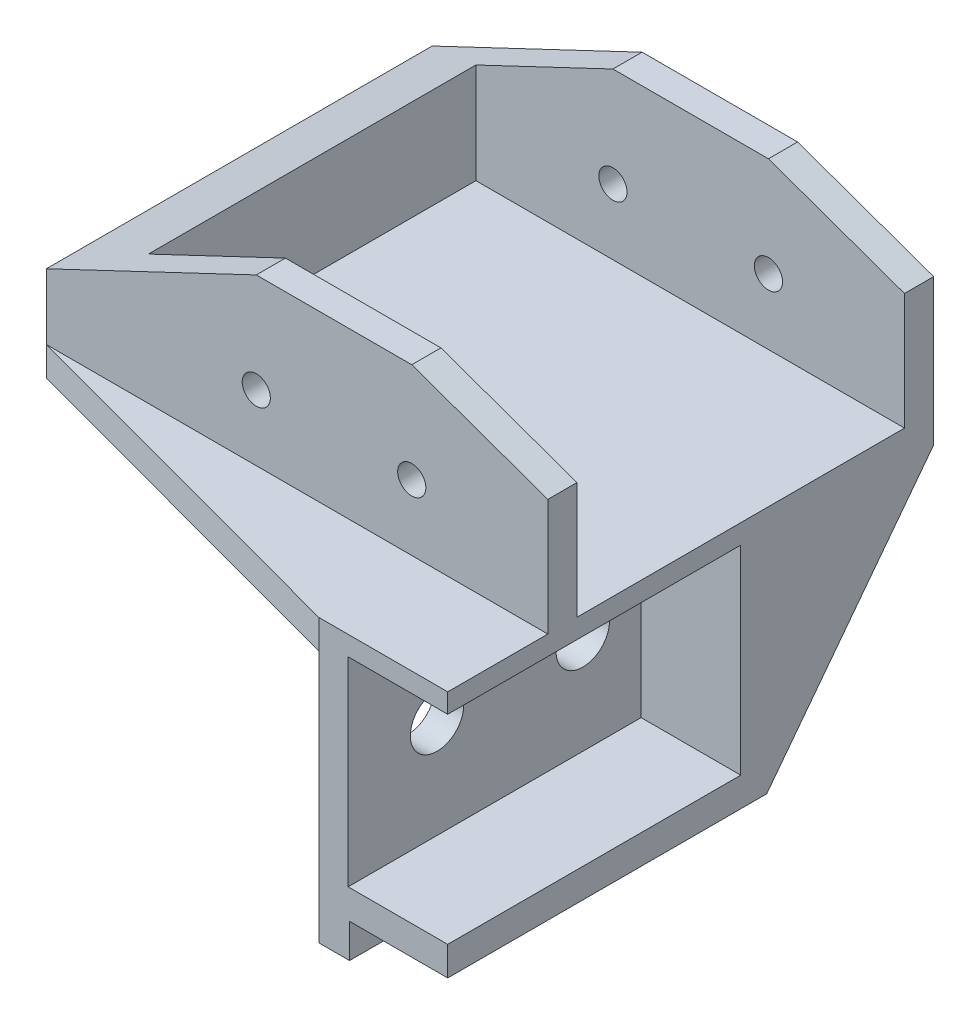
ISO-10303-21;
HEADER;
FILE_DESCRIPTION(('STEP AP214'),'2;1');
FILE_NAME('part.step','',(''),(''),'','','');
FILE_SCHEMA(('AUTOMOTIVE_DESIGN { 1 0 10303 214 1 1 1 1 }'));
ENDSEC;
DATA;
#1=APPLICATION_CONTEXT('core data for automotive mechanical design processes');
#2=APPLICATION_PROTOCOL_DEFINITION('international standard','automotive_design',2000,#1);
#3=PRODUCT_CONTEXT('',#1,'mechanical');
#4=PRODUCT('Part','Part','',(#3));
#5=PRODUCT_RELATED_PRODUCT_CATEGORY('part','',(#4));
#6=PRODUCT_DEFINITION_FORMATION('','',#4);
#7=PRODUCT_DEFINITION_CONTEXT('part definition',#1,'design');
#8=PRODUCT_DEFINITION('design','',#6,#7);
#9=PRODUCT_DEFINITION_SHAPE('','',#8);
#10=(LENGTH_UNIT() NAMED_UNIT(*) SI_UNIT(.MILLI.,.METRE.));
#11=(NAMED_UNIT(*) PLANE_ANGLE_UNIT() SI_UNIT($,.RADIAN.));
#12=(NAMED_UNIT(*) SI_UNIT($,.STERADIAN.) SOLID_ANGLE_UNIT());
#13=UNCERTAINTY_MEASURE_WITH_UNIT(LENGTH_MEASURE(1.E-05),#10,'distance_accuracy_value','');
#14=(GEOMETRIC_REPRESENTATION_CONTEXT(3) GLOBAL_UNCERTAINTY_ASSIGNED_CONTEXT((#13)) GLOBAL_UNIT_ASSIGNED_CONTEXT((#10,
#11,#12)) REPRESENTATION_CONTEXT('',''));
#15=CARTESIAN_POINT('',(0.,0.,0.));
#16=DIRECTION('',(0.,0.,1.));
#17=DIRECTION('',(1.,0.,0.));
#18=AXIS2_PLACEMENT_3D('',#15,#16,#17);
#19=CARTESIAN_POINT('',(0.,0.,39.7));
#20=DIRECTION('',(0.,0.,-1.));
#21=DIRECTION('',(-1.,0.,0.));
#22=AXIS2_PLACEMENT_3D('',#19,#20,#21);
#23=PLANE('',#22);
#24=CARTESIAN_POINT('',(-81.6,9.74999999999999,39.7));
#25=DIRECTION('',(0.,0.,-1.));
#26=DIRECTION('',(-1.,0.,0.));
#27=AXIS2_PLACEMENT_3D('',#24,#25,#26);
#28=CIRCLE('',#27,1.44999999999999);
#29=CARTESIAN_POINT('',(-83.05,9.74999999999999,39.7));
#30=VERTEX_POINT('',#29);
#31=EDGE_CURVE('E389',#30,#30,#28,.T.);
#32=ORIENTED_EDGE('',*,*,#31,.T.);
#33=EDGE_LOOP('',(#32));
#34=FACE_BOUND('',#33,.T.);
#35=CARTESIAN_POINT('',(-65.6,9.74999999999999,39.7));
#36=DIRECTION('',(0.,0.,-1.));
#37=DIRECTION('',(-1.,0.,0.));
#38=AXIS2_PLACEMENT_3D('',#35,#36,#37);
#39=CIRCLE('',#38,1.44999999999999);
#40=CARTESIAN_POINT('',(-67.05,9.74999999999999,39.7));
#41=VERTEX_POINT('',#40);
#42=EDGE_CURVE('E379',#41,#41,#39,.T.);
#43=ORIENTED_EDGE('',*,*,#42,.T.);
#44=EDGE_LOOP('',(#43));
#45=FACE_BOUND('',#44,.T.);
#46=DIRECTION('',(-1.,0.,0.));
#47=VECTOR('',#46,1.);
#48=CARTESIAN_POINT('',(0.,3.,39.7));
#49=LINE('',#48,#47);
#50=CARTESIAN_POINT('',(-51.6,2.99999999999999,39.7));
#51=VERTEX_POINT('',#50);
#52=CARTESIAN_POINT('',(-103.2,3.,39.7));
#53=VERTEX_POINT('',#52);
#54=EDGE_CURVE('E274',#51,#53,#49,.T.);
#55=ORIENTED_EDGE('',*,*,#54,.F.);
#56=DIRECTION('',(0.,1.,0.));
#57=VECTOR('',#56,1.);
#58=CARTESIAN_POINT('',(-51.6,0.,39.7));
#59=LINE('',#58,#57);
#60=CARTESIAN_POINT('',(-51.6,15.,39.7));
#61=VERTEX_POINT('',#60);
#62=EDGE_CURVE('E445',#51,#61,#59,.T.);
#63=ORIENTED_EDGE('',*,*,#62,.T.);
#64=DIRECTION('',(0.941741911594838,-0.336336396998156,0.));
#65=VECTOR('',#64,1.);
#66=CARTESIAN_POINT('',(-1.08597285067873,-3.04072398190046,39.7));
#67=LINE('',#66,#65);
#68=CARTESIAN_POINT('',(-65.6,20.,39.7));
#69=VERTEX_POINT('',#68);
#70=EDGE_CURVE('E356',#69,#61,#67,.T.);
#71=ORIENTED_EDGE('',*,*,#70,.F.);
#72=DIRECTION('',(-1.,0.,0.));
#73=VECTOR('',#72,1.);
#74=CARTESIAN_POINT('',(-103.2,20.,39.7));
#75=LINE('',#74,#73);
#76=CARTESIAN_POINT('',(-81.6,20.,39.7));
#77=VERTEX_POINT('',#76);
#78=EDGE_CURVE('E299',#69,#77,#75,.T.);
#79=ORIENTED_EDGE('',*,*,#78,.T.);
#80=DIRECTION('',(0.903439539264527,0.428715522104694,0.));
#81=VECTOR('',#80,1.);
#82=CARTESIAN_POINT('',(-22.7442061850259,47.9292540094205,39.7));
#83=LINE('',#82,#81);
#84=CARTESIAN_POINT('',(-103.2,9.75000000000001,39.7));
#85=VERTEX_POINT('',#84);
#86=EDGE_CURVE('E329',#85,#77,#83,.T.);
#87=ORIENTED_EDGE('',*,*,#86,.F.);
#88=DIRECTION('',(0.,-1.,0.));
#89=VECTOR('',#88,1.);
#90=CARTESIAN_POINT('',(-103.2,0.,39.7));
#91=LINE('',#90,#89);
#92=EDGE_CURVE('E302',#85,#53,#91,.T.);
#93=ORIENTED_EDGE('',*,*,#92,.T.);
#94=EDGE_LOOP('',(#55,#63,#71,#79,#87,#93));
#95=FACE_BOUND('',#94,.T.);
#96=ADVANCED_FACE('F43',(#34,#45,#95),#23,.F.);
#97=CARTESIAN_POINT('',(-103.2,20.,39.7));
#98=DIRECTION('',(0.,-1.,0.));
#99=DIRECTION('',(1.,0.,0.));
#100=AXIS2_PLACEMENT_3D('',#97,#98,#99);
#101=PLANE('',#100);
#102=DIRECTION('',(0.,0.,-1.));
#103=VECTOR('',#102,1.);
#104=CARTESIAN_POINT('',(-81.6,20.,50.));
#105=LINE('',#104,#103);
#106=CARTESIAN_POINT('',(-81.6,20.,36.7));
#107=VERTEX_POINT('',#106);
#108=EDGE_CURVE('E65',#77,#107,#105,.T.);
#109=ORIENTED_EDGE('',*,*,#108,.F.);
#110=ORIENTED_EDGE('',*,*,#78,.F.);
#111=DIRECTION('',(0.,0.,-1.));
#112=VECTOR('',#111,1.);
#113=CARTESIAN_POINT('',(-65.6,20.,50.));
#114=LINE('',#113,#112);
#115=CARTESIAN_POINT('',(-65.6,20.,36.7));
#116=VERTEX_POINT('',#115);
#117=EDGE_CURVE('E336',#69,#116,#114,.T.);
#118=ORIENTED_EDGE('',*,*,#117,.T.);
#119=DIRECTION('',(1.,0.,0.));
#120=VECTOR('',#119,1.);
#121=CARTESIAN_POINT('',(-95.7,20.,36.7));
#122=LINE('',#121,#120);
#123=EDGE_CURVE('E279',#107,#116,#122,.T.);
#124=ORIENTED_EDGE('',*,*,#123,.F.);
#125=EDGE_LOOP('',(#109,#110,#118,#124));
#126=FACE_BOUND('',#125,.T.);
#127=ADVANCED_FACE('F45',(#126),#101,.F.);
#128=CARTESIAN_POINT('',(-81.6,20.,3.));
#129=VERTEX_POINT('',#128);
#130=CARTESIAN_POINT('',(-81.6,20.,0.));
#131=VERTEX_POINT('',#130);
#132=EDGE_CURVE('E452',#129,#131,#105,.T.);
#133=ORIENTED_EDGE('',*,*,#132,.F.);
#134=DIRECTION('',(-1.,0.,0.));
#135=VECTOR('',#134,1.);
#136=CARTESIAN_POINT('',(-95.7,20.,3.));
#137=LINE('',#136,#135);
#138=CARTESIAN_POINT('',(-65.6000000000001,20.,3.));
#139=VERTEX_POINT('',#138);
#140=EDGE_CURVE('E289',#139,#129,#137,.T.);
#141=ORIENTED_EDGE('',*,*,#140,.F.);
#142=CARTESIAN_POINT('',(-65.6,20.,0.));
#143=VERTEX_POINT('',#142);
#144=EDGE_CURVE('E58',#139,#143,#114,.T.);
#145=ORIENTED_EDGE('',*,*,#144,.T.);
#146=DIRECTION('',(-1.,0.,0.));
#147=VECTOR('',#146,1.);
#148=CARTESIAN_POINT('',(-103.2,20.,0.));
#149=LINE('',#148,#147);
#150=EDGE_CURVE('E298',#143,#131,#149,.T.);
#151=ORIENTED_EDGE('',*,*,#150,.T.);
#152=EDGE_LOOP('',(#133,#141,#145,#151));
#153=FACE_BOUND('',#152,.T.);
#154=ADVANCED_FACE('F465',(#153),#101,.F.);
#155=CARTESIAN_POINT('',(-103.2,0.,39.7));
#156=DIRECTION('',(1.,0.,0.));
#157=DIRECTION('',(0.,0.,-1.));
#158=AXIS2_PLACEMENT_3D('',#155,#156,#157);
#159=PLANE('',#158);
#160=DIRECTION('',(0.,0.,-1.));
#161=VECTOR('',#160,1.);
#162=CARTESIAN_POINT('',(-103.2,9.75000000000001,50.));
#163=LINE('',#162,#161);
#164=CARTESIAN_POINT('',(-103.2,9.75000000000001,0.));
#165=VERTEX_POINT('',#164);
#166=EDGE_CURVE('E451',#85,#165,#163,.T.);
#167=ORIENTED_EDGE('',*,*,#166,.T.);
#168=DIRECTION('',(0.,-1.,0.));
#169=VECTOR('',#168,1.);
#170=CARTESIAN_POINT('',(-103.2,0.,0.));
#171=LINE('',#170,#169);
#172=CARTESIAN_POINT('',(-103.2,0.,0.));
#173=VERTEX_POINT('',#172);
#174=EDGE_CURVE('E309',#165,#173,#171,.T.);
#175=ORIENTED_EDGE('',*,*,#174,.T.);
#176=DIRECTION('',(0.,0.,-1.));
#177=VECTOR('',#176,1.);
#178=CARTESIAN_POINT('',(-103.2,0.,39.7));
#179=LINE('',#178,#177);
#180=CARTESIAN_POINT('',(-103.2,0.,39.7));
#181=VERTEX_POINT('',#180);
#182=EDGE_CURVE('E306',#181,#173,#179,.T.);
#183=ORIENTED_EDGE('',*,*,#182,.F.);
#184=DIRECTION('',(0.,-1.,0.));
#185=VECTOR('',#184,1.);
#186=CARTESIAN_POINT('',(-103.2,42.709098453629,39.7));
#187=LINE('',#186,#185);
#188=EDGE_CURVE('E395',#53,#181,#187,.T.);
#189=ORIENTED_EDGE('',*,*,#188,.F.);
#190=ORIENTED_EDGE('',*,*,#92,.F.);
#191=EDGE_LOOP('',(#167,#175,#183,#189,#190));
#192=FACE_BOUND('',#191,.T.);
#193=ADVANCED_FACE('F467',(#192),#159,.F.);
#194=CARTESIAN_POINT('',(0.,0.,0.));
#195=DIRECTION('',(0.,0.,-1.));
#196=DIRECTION('',(-1.,0.,0.));
#197=AXIS2_PLACEMENT_3D('',#194,#195,#196);
#198=PLANE('',#197);
#199=DIRECTION('',(0.,-1.,0.));
#200=VECTOR('',#199,1.);
#201=CARTESIAN_POINT('',(-51.6,20.,0.));
#202=LINE('',#201,#200);
#203=CARTESIAN_POINT('',(-51.6,15.,0.));
#204=VERTEX_POINT('',#203);
#205=CARTESIAN_POINT('',(-51.6,0.,0.));
#206=VERTEX_POINT('',#205);
#207=EDGE_CURVE('E197',#204,#206,#202,.T.);
#208=ORIENTED_EDGE('',*,*,#207,.T.);
#209=DIRECTION('',(1.,0.,0.));
#210=VECTOR('',#209,1.);
#211=CARTESIAN_POINT('',(-103.2,0.,0.));
#212=LINE('',#211,#210);
#213=CARTESIAN_POINT('',(-64.85,0.,0.));
#214=VERTEX_POINT('',#213);
#215=EDGE_CURVE('E212',#214,#206,#212,.T.);
#216=ORIENTED_EDGE('',*,*,#215,.F.);
#217=DIRECTION('',(1.,0.,0.));
#218=VECTOR('',#217,1.);
#219=CARTESIAN_POINT('',(0.,0.,0.));
#220=LINE('',#219,#218);
#221=EDGE_CURVE('E303',#173,#214,#220,.T.);
#222=ORIENTED_EDGE('',*,*,#221,.F.);
#223=ORIENTED_EDGE('',*,*,#174,.F.);
#224=DIRECTION('',(0.903439539264527,0.428715522104694,0.));
#225=VECTOR('',#224,1.);
#226=CARTESIAN_POINT('',(-22.7442061850259,47.9292540094205,0.));
#227=LINE('',#226,#225);
#228=EDGE_CURVE('E448',#165,#131,#227,.T.);
#229=ORIENTED_EDGE('',*,*,#228,.T.);
#230=ORIENTED_EDGE('',*,*,#150,.F.);
#231=DIRECTION('',(0.941741911594838,-0.336336396998156,0.));
#232=VECTOR('',#231,1.);
#233=CARTESIAN_POINT('',(-65.6,20.,0.));
#234=LINE('',#233,#232);
#235=EDGE_CURVE('E215',#143,#204,#234,.T.);
#236=ORIENTED_EDGE('',*,*,#235,.T.);
#237=EDGE_LOOP('',(#208,#216,#222,#223,#229,#230,#236));
#238=FACE_BOUND('',#237,.T.);
#239=CARTESIAN_POINT('',(-65.6,9.74999999999999,0.));
#240=DIRECTION('',(0.,0.,-1.));
#241=DIRECTION('',(-1.,0.,0.));
#242=AXIS2_PLACEMENT_3D('',#239,#240,#241);
#243=CIRCLE('',#242,1.475);
#244=CARTESIAN_POINT('',(-67.075,9.74999999999999,0.));
#245=VERTEX_POINT('',#244);
#246=EDGE_CURVE('E372',#245,#245,#243,.T.);
#247=ORIENTED_EDGE('',*,*,#246,.F.);
#248=EDGE_LOOP('',(#247));
#249=FACE_BOUND('',#248,.T.);
#250=CARTESIAN_POINT('',(-81.6,9.74999999999999,0.));
#251=DIRECTION('',(0.,0.,-1.));
#252=DIRECTION('',(-1.,0.,0.));
#253=AXIS2_PLACEMENT_3D('',#250,#251,#252);
#254=CIRCLE('',#253,1.475);
#255=CARTESIAN_POINT('',(-83.075,9.74999999999999,0.));
#256=VERTEX_POINT('',#255);
#257=EDGE_CURVE('E382',#256,#256,#254,.T.);
#258=ORIENTED_EDGE('',*,*,#257,.F.);
#259=EDGE_LOOP('',(#258));
#260=FACE_BOUND('',#259,.T.);
#261=ADVANCED_FACE('F209',(#238,#249,#260),#198,.T.);
#262=CARTESIAN_POINT('',(-95.7,-94.4189070049002,3.));
#263=DIRECTION('',(-1.,0.,0.));
#264=DIRECTION('',(0.,0.,1.));
#265=AXIS2_PLACEMENT_3D('',#262,#263,#264);
#266=PLANE('',#265);
#267=DIRECTION('',(0.,0.,-1.));
#268=VECTOR('',#267,1.);
#269=CARTESIAN_POINT('',(-95.7,13.3090277777778,3.));
#270=LINE('',#269,#268);
#271=CARTESIAN_POINT('',(-95.7,13.3090277777778,36.7));
#272=VERTEX_POINT('',#271);
#273=CARTESIAN_POINT('',(-95.7,13.3090277777778,3.));
#274=VERTEX_POINT('',#273);
#275=EDGE_CURVE('E350',#272,#274,#270,.T.);
#276=ORIENTED_EDGE('',*,*,#275,.F.);
#277=DIRECTION('',(0.,1.,0.));
#278=VECTOR('',#277,1.);
#279=CARTESIAN_POINT('',(-95.7,-94.4189070049002,36.7));
#280=LINE('',#279,#278);
#281=CARTESIAN_POINT('',(-95.7,2.99999999999999,36.7));
#282=VERTEX_POINT('',#281);
#283=EDGE_CURVE('E292',#282,#272,#280,.T.);
#284=ORIENTED_EDGE('',*,*,#283,.F.);
#285=DIRECTION('',(0.,0.,-1.));
#286=VECTOR('',#285,1.);
#287=CARTESIAN_POINT('',(-95.7,2.99999999999999,3.));
#288=LINE('',#287,#286);
#289=CARTESIAN_POINT('',(-95.7,2.99999999999999,3.));
#290=VERTEX_POINT('',#289);
#291=EDGE_CURVE('E283',#282,#290,#288,.T.);
#292=ORIENTED_EDGE('',*,*,#291,.T.);
#293=DIRECTION('',(0.,1.,0.));
#294=VECTOR('',#293,1.);
#295=CARTESIAN_POINT('',(-95.7,-94.4189070049002,3.));
#296=LINE('',#295,#294);
#297=EDGE_CURVE('E284',#290,#274,#296,.T.);
#298=ORIENTED_EDGE('',*,*,#297,.T.);
#299=EDGE_LOOP('',(#276,#284,#292,#298));
#300=FACE_BOUND('',#299,.T.);
#301=ADVANCED_FACE('F353',(#300),#266,.F.);
#302=CARTESIAN_POINT('',(-95.7,-94.4189070049002,3.));
#303=DIRECTION('',(0.,0.,-1.));
#304=DIRECTION('',(-1.,0.,0.));
#305=AXIS2_PLACEMENT_3D('',#302,#303,#304);
#306=PLANE('',#305);
#307=CARTESIAN_POINT('',(-81.6,9.74999999999999,3.));
#308=DIRECTION('',(0.,0.,-1.));
#309=DIRECTION('',(-1.,0.,0.));
#310=AXIS2_PLACEMENT_3D('',#307,#308,#309);
#311=CIRCLE('',#310,1.44999999999999);
#312=CARTESIAN_POINT('',(-83.05,9.74999999999999,3.));
#313=VERTEX_POINT('',#312);
#314=EDGE_CURVE('E316',#313,#313,#311,.T.);
#315=ORIENTED_EDGE('',*,*,#314,.T.);
#316=EDGE_LOOP('',(#315));
#317=FACE_BOUND('',#316,.T.);
#318=CARTESIAN_POINT('',(-65.6,9.74999999999999,3.));
#319=DIRECTION('',(0.,0.,-1.));
#320=DIRECTION('',(-1.,0.,0.));
#321=AXIS2_PLACEMENT_3D('',#318,#319,#320);
#322=CIRCLE('',#321,1.44999999999999);
#323=CARTESIAN_POINT('',(-67.05,9.74999999999999,3.));
#324=VERTEX_POINT('',#323);
#325=EDGE_CURVE('E321',#324,#324,#322,.T.);
#326=ORIENTED_EDGE('',*,*,#325,.T.);
#327=EDGE_LOOP('',(#326));
#328=FACE_BOUND('',#327,.T.);
#329=DIRECTION('',(1.,0.,0.));
#330=VECTOR('',#329,1.);
#331=CARTESIAN_POINT('',(-95.7,2.99999999999999,3.));
#332=LINE('',#331,#330);
#333=CARTESIAN_POINT('',(-51.6,2.99999999999999,3.));
#334=VERTEX_POINT('',#333);
#335=EDGE_CURVE('E280',#290,#334,#332,.T.);
#336=ORIENTED_EDGE('',*,*,#335,.T.);
#337=DIRECTION('',(0.,1.,0.));
#338=VECTOR('',#337,1.);
#339=CARTESIAN_POINT('',(-51.6,-94.4189070049002,3.));
#340=LINE('',#339,#338);
#341=CARTESIAN_POINT('',(-51.6,15.,3.));
#342=VERTEX_POINT('',#341);
#343=EDGE_CURVE('E462',#334,#342,#340,.T.);
#344=ORIENTED_EDGE('',*,*,#343,.T.);
#345=DIRECTION('',(0.941741911594838,-0.336336396998156,0.));
#346=VECTOR('',#345,1.);
#347=CARTESIAN_POINT('',(-56.0537398627013,16.5906213795362,3.));
#348=LINE('',#347,#346);
#349=EDGE_CURVE('E359',#139,#342,#348,.T.);
#350=ORIENTED_EDGE('',*,*,#349,.F.);
#351=ORIENTED_EDGE('',*,*,#140,.T.);
#352=DIRECTION('',(0.903439539264527,0.428715522104694,0.));
#353=VECTOR('',#352,1.);
#354=CARTESIAN_POINT('',(-137.425027900205,-6.4910433322731,3.00000000000001));
#355=LINE('',#354,#353);
#356=EDGE_CURVE('E355',#274,#129,#355,.T.);
#357=ORIENTED_EDGE('',*,*,#356,.F.);
#358=ORIENTED_EDGE('',*,*,#297,.F.);
#359=EDGE_LOOP('',(#336,#344,#350,#351,#357,#358));
#360=FACE_BOUND('',#359,.T.);
#361=ADVANCED_FACE('F461',(#317,#328,#360),#306,.F.);
#362=CARTESIAN_POINT('',(-95.7,-94.4189070049002,36.7));
#363=DIRECTION('',(0.,0.,1.));
#364=DIRECTION('',(1.,0.,0.));
#365=AXIS2_PLACEMENT_3D('',#362,#363,#364);
#366=PLANE('',#365);
#367=CARTESIAN_POINT('',(-81.6,9.74999999999999,36.7));
#368=DIRECTION('',(0.,0.,1.));
#369=DIRECTION('',(1.,0.,0.));
#370=AXIS2_PLACEMENT_3D('',#367,#368,#369);
#371=CIRCLE('',#370,1.44999999999999);
#372=CARTESIAN_POINT('',(-80.15,9.74999999999999,36.7));
#373=VERTEX_POINT('',#372);
#374=EDGE_CURVE('E319',#373,#373,#371,.T.);
#375=ORIENTED_EDGE('',*,*,#374,.T.);
#376=EDGE_LOOP('',(#375));
#377=FACE_BOUND('',#376,.T.);
#378=CARTESIAN_POINT('',(-65.6,9.74999999999999,36.7));
#379=DIRECTION('',(0.,0.,1.));
#380=DIRECTION('',(1.,0.,0.));
#381=AXIS2_PLACEMENT_3D('',#378,#379,#380);
#382=CIRCLE('',#381,1.44999999999999);
#383=CARTESIAN_POINT('',(-64.15,9.74999999999999,36.7));
#384=VERTEX_POINT('',#383);
#385=EDGE_CURVE('E324',#384,#384,#382,.T.);
#386=ORIENTED_EDGE('',*,*,#385,.T.);
#387=EDGE_LOOP('',(#386));
#388=FACE_BOUND('',#387,.T.);
#389=DIRECTION('',(-0.941741911594838,0.336336396998156,0.));
#390=VECTOR('',#389,1.);
#391=CARTESIAN_POINT('',(-56.0537398627013,16.5906213795362,36.7));
#392=LINE('',#391,#390);
#393=CARTESIAN_POINT('',(-51.6,15.,36.7));
#394=VERTEX_POINT('',#393);
#395=EDGE_CURVE('E51',#394,#116,#392,.T.);
#396=ORIENTED_EDGE('',*,*,#395,.F.);
#397=DIRECTION('',(0.,-1.,0.));
#398=VECTOR('',#397,1.);
#399=CARTESIAN_POINT('',(-51.6,-94.4189070049002,36.7));
#400=LINE('',#399,#398);
#401=CARTESIAN_POINT('',(-51.6,2.99999999999999,36.7));
#402=VERTEX_POINT('',#401);
#403=EDGE_CURVE('E204',#394,#402,#400,.T.);
#404=ORIENTED_EDGE('',*,*,#403,.T.);
#405=DIRECTION('',(-1.,0.,0.));
#406=VECTOR('',#405,1.);
#407=CARTESIAN_POINT('',(-95.7,2.99999999999999,36.7));
#408=LINE('',#407,#406);
#409=EDGE_CURVE('E286',#402,#282,#408,.T.);
#410=ORIENTED_EDGE('',*,*,#409,.T.);
#411=ORIENTED_EDGE('',*,*,#283,.T.);
#412=DIRECTION('',(-0.903439539264527,-0.428715522104694,0.));
#413=VECTOR('',#412,1.);
#414=CARTESIAN_POINT('',(-137.425027900205,-6.4910433322731,36.7));
#415=LINE('',#414,#413);
#416=EDGE_CURVE('E12',#107,#272,#415,.T.);
#417=ORIENTED_EDGE('',*,*,#416,.F.);
#418=ORIENTED_EDGE('',*,*,#123,.T.);
#419=EDGE_LOOP('',(#396,#404,#410,#411,#417,#418));
#420=FACE_BOUND('',#419,.T.);
#421=ADVANCED_FACE('F346',(#377,#388,#420),#366,.F.);
#422=CARTESIAN_POINT('',(0.,-26.,0.));
#423=DIRECTION('',(0.,-1.,0.));
#424=DIRECTION('',(1.,0.,0.));
#425=AXIS2_PLACEMENT_3D('',#422,#423,#424);
#426=PLANE('',#425);
#427=DIRECTION('',(1.,0.,0.));
#428=VECTOR('',#427,1.);
#429=CARTESIAN_POINT('',(-103.2,-26.,19.85));
#430=LINE('',#429,#428);
#431=CARTESIAN_POINT('',(-64.85,-26.,19.85));
#432=VERTEX_POINT('',#431);
#433=CARTESIAN_POINT('',(-61.7,-26.,19.85));
#434=VERTEX_POINT('',#433);
#435=EDGE_CURVE('E222',#432,#434,#430,.T.);
#436=ORIENTED_EDGE('',*,*,#435,.T.);
#437=DIRECTION('',(0.,0.,-1.));
#438=VECTOR('',#437,1.);
#439=CARTESIAN_POINT('',(-61.7,-26.,0.));
#440=LINE('',#439,#438);
#441=CARTESIAN_POINT('',(-61.7,-26.,50.));
#442=VERTEX_POINT('',#441);
#443=EDGE_CURVE('E233',#442,#434,#440,.T.);
#444=ORIENTED_EDGE('',*,*,#443,.F.);
#445=DIRECTION('',(-1.,0.,0.));
#446=VECTOR('',#445,1.);
#447=CARTESIAN_POINT('',(-64.85,-26.,50.));
#448=LINE('',#447,#446);
#449=CARTESIAN_POINT('',(-64.85,-26.,50.));
#450=VERTEX_POINT('',#449);
#451=EDGE_CURVE('E265',#442,#450,#448,.T.);
#452=ORIENTED_EDGE('',*,*,#451,.T.);
#453=DIRECTION('',(0.,0.,-1.));
#454=VECTOR('',#453,1.);
#455=CARTESIAN_POINT('',(-64.85,-26.,0.));
#456=LINE('',#455,#454);
#457=EDGE_CURVE('E267',#450,#432,#456,.T.);
#458=ORIENTED_EDGE('',*,*,#457,.T.);
#459=EDGE_LOOP('',(#436,#444,#452,#458));
#460=FACE_BOUND('',#459,.T.);
#461=ADVANCED_FACE('F420',(#460),#426,.T.);
#462=CARTESIAN_POINT('',(0.,0.,39.7));
#463=DIRECTION('',(0.,1.,0.));
#464=DIRECTION('',(-1.,0.,0.));
#465=AXIS2_PLACEMENT_3D('',#462,#463,#464);
#466=PLANE('',#465);
#467=DIRECTION('',(0.,0.,-1.));
#468=VECTOR('',#467,1.);
#469=CARTESIAN_POINT('',(-64.85,0.,39.7));
#470=LINE('',#469,#468);
#471=CARTESIAN_POINT('',(-64.85,0.,50.));
#472=VERTEX_POINT('',#471);
#473=EDGE_CURVE('E276',#472,#214,#470,.T.);
#474=ORIENTED_EDGE('',*,*,#473,.F.);
#475=DIRECTION('',(-0.965773626031422,0.,-0.259386397604267));
#476=VECTOR('',#475,1.);
#477=CARTESIAN_POINT('',(-64.85,0.,50.));
#478=LINE('',#477,#476);
#479=EDGE_CURVE('E227',#472,#181,#478,.T.);
#480=ORIENTED_EDGE('',*,*,#479,.T.);
#481=ORIENTED_EDGE('',*,*,#182,.T.);
#482=ORIENTED_EDGE('',*,*,#221,.T.);
#483=EDGE_LOOP('',(#474,#480,#481,#482));
#484=FACE_BOUND('',#483,.T.);
#485=ADVANCED_FACE('F409',(#484),#466,.F.);
#486=CARTESIAN_POINT('',(0.,3.,39.7));
#487=DIRECTION('',(0.,1.,0.));
#488=DIRECTION('',(-1.,0.,0.));
#489=AXIS2_PLACEMENT_3D('',#486,#487,#488);
#490=PLANE('',#489);
#491=DIRECTION('',(0.,0.,1.));
#492=VECTOR('',#491,1.);
#493=CARTESIAN_POINT('',(-51.6,2.99999999999999,39.7));
#494=LINE('',#493,#492);
#495=EDGE_CURVE('E779',#334,#402,#494,.T.);
#496=ORIENTED_EDGE('',*,*,#495,.F.);
#497=ORIENTED_EDGE('',*,*,#335,.F.);
#498=ORIENTED_EDGE('',*,*,#291,.F.);
#499=ORIENTED_EDGE('',*,*,#409,.F.);
#500=EDGE_LOOP('',(#496,#497,#498,#499));
#501=FACE_BOUND('',#500,.T.);
#502=ADVANCED_FACE('F482',(#501),#490,.T.);
#503=CARTESIAN_POINT('',(-64.85,-26.,0.));
#504=DIRECTION('',(1.,0.,0.));
#505=DIRECTION('',(0.,1.,0.));
#506=AXIS2_PLACEMENT_3D('',#503,#504,#505);
#507=PLANE('',#506);
#508=CARTESIAN_POINT('',(-64.85,-9.24999999999995,25.85));
#509=DIRECTION('',(1.,0.,0.));
#510=DIRECTION('',(0.,1.,0.));
#511=AXIS2_PLACEMENT_3D('',#508,#509,#510);
#512=CIRCLE('',#511,2.74999999999999);
#513=CARTESIAN_POINT('',(-64.85,-6.49999999999996,25.85));
#514=VERTEX_POINT('',#513);
#515=EDGE_CURVE('E328',#514,#514,#512,.T.);
#516=ORIENTED_EDGE('',*,*,#515,.T.);
#517=EDGE_LOOP('',(#516));
#518=FACE_BOUND('',#517,.T.);
#519=CARTESIAN_POINT('',(-64.85,-9.24999999999995,40.85));
#520=DIRECTION('',(1.,0.,0.));
#521=DIRECTION('',(0.,1.,0.));
#522=AXIS2_PLACEMENT_3D('',#519,#520,#521);
#523=CIRCLE('',#522,2.74999999999999);
#524=CARTESIAN_POINT('',(-64.85,-6.49999999999996,40.85));
#525=VERTEX_POINT('',#524);
#526=EDGE_CURVE('E366',#525,#525,#523,.T.);
#527=ORIENTED_EDGE('',*,*,#526,.T.);
#528=EDGE_LOOP('',(#527));
#529=FACE_BOUND('',#528,.T.);
#530=DIRECTION('',(0.,1.,0.));
#531=VECTOR('',#530,1.);
#532=CARTESIAN_POINT('',(-64.85,-26.,50.));
#533=LINE('',#532,#531);
#534=EDGE_CURVE('E270',#450,#472,#533,.T.);
#535=ORIENTED_EDGE('',*,*,#534,.T.);
#536=ORIENTED_EDGE('',*,*,#473,.T.);
#537=DIRECTION('',(0.,-0.794834835806078,0.606825826567332));
#538=VECTOR('',#537,1.);
#539=CARTESIAN_POINT('',(-64.85,-16.4258228214827,12.5404839617859));
#540=LINE('',#539,#538);
#541=EDGE_CURVE('E220',#214,#432,#540,.T.);
#542=ORIENTED_EDGE('',*,*,#541,.T.);
#543=ORIENTED_EDGE('',*,*,#457,.F.);
#544=EDGE_LOOP('',(#535,#536,#542,#543));
#545=FACE_BOUND('',#544,.T.);
#546=ADVANCED_FACE('F418',(#518,#529,#545),#507,.F.);
#547=CARTESIAN_POINT('',(0.,3.,0.));
#548=DIRECTION('',(0.,-1.,0.));
#549=DIRECTION('',(1.,0.,0.));
#550=AXIS2_PLACEMENT_3D('',#547,#548,#549);
#551=PLANE('',#550);
#552=DIRECTION('',(-1.,0.,0.));
#553=VECTOR('',#552,1.);
#554=CARTESIAN_POINT('',(-64.85,2.99999999999999,50.));
#555=LINE('',#554,#553);
#556=CARTESIAN_POINT('',(-51.6,3.,50.));
#557=VERTEX_POINT('',#556);
#558=CARTESIAN_POINT('',(-64.85,3.,50.));
#559=VERTEX_POINT('',#558);
#560=EDGE_CURVE('E264',#557,#559,#555,.T.);
#561=ORIENTED_EDGE('',*,*,#560,.F.);
#562=DIRECTION('',(0.,0.,-1.));
#563=VECTOR('',#562,1.);
#564=CARTESIAN_POINT('',(-51.6,2.99999999999999,0.));
#565=LINE('',#564,#563);
#566=EDGE_CURVE('E442',#557,#51,#565,.T.);
#567=ORIENTED_EDGE('',*,*,#566,.T.);
#568=ORIENTED_EDGE('',*,*,#54,.T.);
#569=DIRECTION('',(0.965773626031422,0.,0.259386397604267));
#570=VECTOR('',#569,1.);
#571=CARTESIAN_POINT('',(-64.85,3.,50.));
#572=LINE('',#571,#570);
#573=EDGE_CURVE('E392',#53,#559,#572,.T.);
#574=ORIENTED_EDGE('',*,*,#573,.T.);
#575=EDGE_LOOP('',(#561,#567,#568,#574));
#576=FACE_BOUND('',#575,.T.);
#577=ADVANCED_FACE('F472',(#576),#551,.F.);
#578=CARTESIAN_POINT('',(-64.85,-26.,50.));
#579=DIRECTION('',(0.,0.,-1.));
#580=DIRECTION('',(-1.,0.,0.));
#581=AXIS2_PLACEMENT_3D('',#578,#579,#580);
#582=PLANE('',#581);
#583=DIRECTION('',(1.,0.,0.));
#584=VECTOR('',#583,1.);
#585=CARTESIAN_POINT('',(-61.7,-22.5,50.));
#586=LINE('',#585,#584);
#587=CARTESIAN_POINT('',(-61.7,-22.5,50.));
#588=VERTEX_POINT('',#587);
#589=CARTESIAN_POINT('',(-51.6,-22.5,50.));
#590=VERTEX_POINT('',#589);
#591=EDGE_CURVE('E234',#588,#590,#586,.T.);
#592=ORIENTED_EDGE('',*,*,#591,.T.);
#593=DIRECTION('',(0.,1.,0.));
#594=VECTOR('',#593,1.);
#595=CARTESIAN_POINT('',(-51.6,20.,50.));
#596=LINE('',#595,#594);
#597=CARTESIAN_POINT('',(-51.6,-19.5,50.));
#598=VERTEX_POINT('',#597);
#599=EDGE_CURVE('E782',#590,#598,#596,.T.);
#600=ORIENTED_EDGE('',*,*,#599,.T.);
#601=DIRECTION('',(1.,0.,0.));
#602=VECTOR('',#601,1.);
#603=CARTESIAN_POINT('',(-61.85,-19.5,50.));
#604=LINE('',#603,#602);
#605=CARTESIAN_POINT('',(-61.85,-19.5,50.));
#606=VERTEX_POINT('',#605);
#607=EDGE_CURVE('E247',#606,#598,#604,.T.);
#608=ORIENTED_EDGE('',*,*,#607,.F.);
#609=DIRECTION('',(0.,-1.,0.));
#610=VECTOR('',#609,1.);
#611=CARTESIAN_POINT('',(-61.85,0.999999999999992,50.));
#612=LINE('',#611,#610);
#613=CARTESIAN_POINT('',(-61.85,0.99999999999999,50.));
#614=VERTEX_POINT('',#613);
#615=EDGE_CURVE('E240',#614,#606,#612,.T.);
#616=ORIENTED_EDGE('',*,*,#615,.F.);
#617=DIRECTION('',(-1.,0.,0.));
#618=VECTOR('',#617,1.);
#619=CARTESIAN_POINT('',(-61.85,0.999999999999992,50.));
#620=LINE('',#619,#618);
#621=CARTESIAN_POINT('',(-51.6,0.999999999999994,50.));
#622=VERTEX_POINT('',#621);
#623=EDGE_CURVE('E244',#622,#614,#620,.T.);
#624=ORIENTED_EDGE('',*,*,#623,.F.);
#625=EDGE_CURVE('E216',#622,#557,#596,.T.);
#626=ORIENTED_EDGE('',*,*,#625,.T.);
#627=ORIENTED_EDGE('',*,*,#560,.T.);
#628=DIRECTION('',(0.,-1.,0.));
#629=VECTOR('',#628,1.);
#630=CARTESIAN_POINT('',(-64.85,42.709098453629,50.));
#631=LINE('',#630,#629);
#632=EDGE_CURVE('E396',#559,#472,#631,.T.);
#633=ORIENTED_EDGE('',*,*,#632,.T.);
#634=ORIENTED_EDGE('',*,*,#534,.F.);
#635=ORIENTED_EDGE('',*,*,#451,.F.);
#636=DIRECTION('',(0.,-1.,0.));
#637=VECTOR('',#636,1.);
#638=CARTESIAN_POINT('',(-61.7,34.4262459290465,50.));
#639=LINE('',#638,#637);
#640=EDGE_CURVE('E238',#588,#442,#639,.T.);
#641=ORIENTED_EDGE('',*,*,#640,.F.);
#642=EDGE_LOOP('',(#592,#600,#608,#616,#624,#626,#627,#633,#634,#635,#641));
#643=FACE_BOUND('',#642,.T.);
#644=ADVANCED_FACE('F413',(#643),#582,.F.);
#645=CARTESIAN_POINT('',(0.,0.,19.85));
#646=DIRECTION('',(0.,0.,-1.));
#647=DIRECTION('',(-1.,0.,0.));
#648=AXIS2_PLACEMENT_3D('',#645,#646,#647);
#649=PLANE('',#648);
#650=DIRECTION('',(1.,0.,0.));
#651=VECTOR('',#650,1.);
#652=CARTESIAN_POINT('',(-61.85,-19.5,19.85));
#653=LINE('',#652,#651);
#654=CARTESIAN_POINT('',(-61.85,-19.5,19.85));
#655=VERTEX_POINT('',#654);
#656=CARTESIAN_POINT('',(-51.6,-19.5,19.85));
#657=VERTEX_POINT('',#656);
#658=EDGE_CURVE('E246',#655,#657,#653,.T.);
#659=ORIENTED_EDGE('',*,*,#658,.T.);
#660=DIRECTION('',(0.,1.,0.));
#661=VECTOR('',#660,1.);
#662=CARTESIAN_POINT('',(-51.6,0.,19.85));
#663=LINE('',#662,#661);
#664=CARTESIAN_POINT('',(-51.6,0.999999999999992,19.85));
#665=VERTEX_POINT('',#664);
#666=EDGE_CURVE('E433',#657,#665,#663,.T.);
#667=ORIENTED_EDGE('',*,*,#666,.T.);
#668=DIRECTION('',(-1.,0.,0.));
#669=VECTOR('',#668,1.);
#670=CARTESIAN_POINT('',(-61.85,0.999999999999992,19.85));
#671=LINE('',#670,#669);
#672=CARTESIAN_POINT('',(-61.85,0.999999999999992,19.85));
#673=VERTEX_POINT('',#672);
#674=EDGE_CURVE('E254',#665,#673,#671,.T.);
#675=ORIENTED_EDGE('',*,*,#674,.T.);
#676=DIRECTION('',(0.,-1.,0.));
#677=VECTOR('',#676,1.);
#678=CARTESIAN_POINT('',(-61.85,0.999999999999992,19.85));
#679=LINE('',#678,#677);
#680=EDGE_CURVE('E255',#673,#655,#679,.T.);
#681=ORIENTED_EDGE('',*,*,#680,.T.);
#682=EDGE_LOOP('',(#659,#667,#675,#681));
#683=FACE_BOUND('',#682,.T.);
#684=ADVANCED_FACE('F479',(#683),#649,.F.);
#685=CARTESIAN_POINT('',(-61.85,-19.5,-28.9913780286485));
#686=DIRECTION('',(0.,-1.,0.));
#687=DIRECTION('',(0.,0.,-1.));
#688=AXIS2_PLACEMENT_3D('',#685,#686,#687);
#689=PLANE('',#688);
#690=ORIENTED_EDGE('',*,*,#607,.T.);
#691=DIRECTION('',(0.,0.,-1.));
#692=VECTOR('',#691,1.);
#693=CARTESIAN_POINT('',(-51.6,-19.5,-28.9913780286485));
#694=LINE('',#693,#692);
#695=EDGE_CURVE('E439',#598,#657,#694,.T.);
#696=ORIENTED_EDGE('',*,*,#695,.T.);
#697=ORIENTED_EDGE('',*,*,#658,.F.);
#698=DIRECTION('',(0.,0.,1.));
#699=VECTOR('',#698,1.);
#700=CARTESIAN_POINT('',(-61.85,-19.5,-28.9913780286485));
#701=LINE('',#700,#699);
#702=EDGE_CURVE('E258',#655,#606,#701,.T.);
#703=ORIENTED_EDGE('',*,*,#702,.T.);
#704=EDGE_LOOP('',(#690,#696,#697,#703));
#705=FACE_BOUND('',#704,.T.);
#706=ADVANCED_FACE('F730',(#705),#689,.F.);
#707=CARTESIAN_POINT('',(-61.85,0.999999999999992,-28.9913780286485));
#708=DIRECTION('',(0.,1.,0.));
#709=DIRECTION('',(0.,0.,1.));
#710=AXIS2_PLACEMENT_3D('',#707,#708,#709);
#711=PLANE('',#710);
#712=ORIENTED_EDGE('',*,*,#674,.F.);
#713=DIRECTION('',(0.,0.,1.));
#714=VECTOR('',#713,1.);
#715=CARTESIAN_POINT('',(-51.6,0.999999999999992,-28.9913780286485));
#716=LINE('',#715,#714);
#717=EDGE_CURVE('E430',#665,#622,#716,.T.);
#718=ORIENTED_EDGE('',*,*,#717,.T.);
#719=ORIENTED_EDGE('',*,*,#623,.T.);
#720=DIRECTION('',(0.,0.,1.));
#721=VECTOR('',#720,1.);
#722=CARTESIAN_POINT('',(-61.85,0.999999999999992,-28.9913780286485));
#723=LINE('',#722,#721);
#724=EDGE_CURVE('E259',#673,#614,#723,.T.);
#725=ORIENTED_EDGE('',*,*,#724,.F.);
#726=EDGE_LOOP('',(#712,#718,#719,#725));
#727=FACE_BOUND('',#726,.T.);
#728=ADVANCED_FACE('F541',(#727),#711,.F.);
#729=CARTESIAN_POINT('',(-61.85,0.999999999999992,-28.9913780286485));
#730=DIRECTION('',(-1.,0.,0.));
#731=DIRECTION('',(0.,-1.,0.));
#732=AXIS2_PLACEMENT_3D('',#729,#730,#731);
#733=PLANE('',#732);
#734=CARTESIAN_POINT('',(-61.85,-9.24999999999995,25.85));
#735=DIRECTION('',(-1.,0.,0.));
#736=DIRECTION('',(0.,-1.,0.));
#737=AXIS2_PLACEMENT_3D('',#734,#735,#736);
#738=CIRCLE('',#737,2.74999999999999);
#739=CARTESIAN_POINT('',(-61.85,-11.9999999999999,25.85));
#740=VERTEX_POINT('',#739);
#741=EDGE_CURVE('E326',#740,#740,#738,.T.);
#742=ORIENTED_EDGE('',*,*,#741,.T.);
#743=EDGE_LOOP('',(#742));
#744=FACE_BOUND('',#743,.T.);
#745=CARTESIAN_POINT('',(-61.85,-9.24999999999995,40.85));
#746=DIRECTION('',(-1.,0.,0.));
#747=DIRECTION('',(0.,-1.,0.));
#748=AXIS2_PLACEMENT_3D('',#745,#746,#747);
#749=CIRCLE('',#748,2.74999999999999);
#750=CARTESIAN_POINT('',(-61.85,-11.9999999999999,40.85));
#751=VERTEX_POINT('',#750);
#752=EDGE_CURVE('E369',#751,#751,#749,.T.);
#753=ORIENTED_EDGE('',*,*,#752,.T.);
#754=EDGE_LOOP('',(#753));
#755=FACE_BOUND('',#754,.T.);
#756=ORIENTED_EDGE('',*,*,#724,.T.);
#757=ORIENTED_EDGE('',*,*,#615,.T.);
#758=ORIENTED_EDGE('',*,*,#702,.F.);
#759=ORIENTED_EDGE('',*,*,#680,.F.);
#760=EDGE_LOOP('',(#756,#757,#758,#759));
#761=FACE_BOUND('',#760,.T.);
#762=ADVANCED_FACE('F538',(#744,#755,#761),#733,.F.);
#763=CARTESIAN_POINT('',(-61.7,34.4262459290465,0.));
#764=DIRECTION('',(-1.,0.,0.));
#765=DIRECTION('',(0.,-1.,0.));
#766=AXIS2_PLACEMENT_3D('',#763,#764,#765);
#767=PLANE('',#766);
#768=ORIENTED_EDGE('',*,*,#443,.T.);
#769=DIRECTION('',(0.,0.794834835806078,-0.606825826567332));
#770=VECTOR('',#769,1.);
#771=CARTESIAN_POINT('',(-61.7,21.7492083092042,-16.6046840360655));
#772=LINE('',#771,#770);
#773=CARTESIAN_POINT('',(-61.7,-22.5,17.1778846153846));
#774=VERTEX_POINT('',#773);
#775=EDGE_CURVE('E221',#434,#774,#772,.T.);
#776=ORIENTED_EDGE('',*,*,#775,.T.);
#777=DIRECTION('',(0.,0.,1.));
#778=VECTOR('',#777,1.);
#779=CARTESIAN_POINT('',(-61.7,-22.5,0.));
#780=LINE('',#779,#778);
#781=EDGE_CURVE('E237',#774,#588,#780,.T.);
#782=ORIENTED_EDGE('',*,*,#781,.T.);
#783=ORIENTED_EDGE('',*,*,#640,.T.);
#784=EDGE_LOOP('',(#768,#776,#782,#783));
#785=FACE_BOUND('',#784,.T.);
#786=ADVANCED_FACE('F426',(#785),#767,.F.);
#787=CARTESIAN_POINT('',(-61.85,-22.5,-28.9913780286485));
#788=DIRECTION('',(0.,-1.,0.));
#789=DIRECTION('',(0.,0.,-1.));
#790=AXIS2_PLACEMENT_3D('',#787,#788,#789);
#791=PLANE('',#790);
#792=DIRECTION('',(0.,0.,-1.));
#793=VECTOR('',#792,1.);
#794=CARTESIAN_POINT('',(-51.6,-22.5,-28.9913780286485));
#795=LINE('',#794,#793);
#796=CARTESIAN_POINT('',(-51.6,-22.5,17.1778846153846));
#797=VERTEX_POINT('',#796);
#798=EDGE_CURVE('E200',#590,#797,#795,.T.);
#799=ORIENTED_EDGE('',*,*,#798,.F.);
#800=ORIENTED_EDGE('',*,*,#591,.F.);
#801=ORIENTED_EDGE('',*,*,#781,.F.);
#802=DIRECTION('',(-1.,0.,0.));
#803=VECTOR('',#802,1.);
#804=CARTESIAN_POINT('',(-61.85,-22.5,17.1778846153846));
#805=LINE('',#804,#803);
#806=EDGE_CURVE('E314',#797,#774,#805,.T.);
#807=ORIENTED_EDGE('',*,*,#806,.F.);
#808=EDGE_LOOP('',(#799,#800,#801,#807));
#809=FACE_BOUND('',#808,.T.);
#810=ADVANCED_FACE('F429',(#809),#791,.T.);
#811=CARTESIAN_POINT('',(-103.2,-26.,19.85));
#812=DIRECTION('',(0.,0.606825826567332,0.794834835806077));
#813=DIRECTION('',(0.,-0.794834835806077,0.606825826567332));
#814=AXIS2_PLACEMENT_3D('',#811,#812,#813);
#815=PLANE('',#814);
#816=ORIENTED_EDGE('',*,*,#215,.T.);
#817=DIRECTION('',(0.,-0.794834835806077,0.606825826567332));
#818=VECTOR('',#817,1.);
#819=CARTESIAN_POINT('',(-51.6,-26.,19.85));
#820=LINE('',#819,#818);
#821=EDGE_CURVE('E194',#206,#797,#820,.T.);
#822=ORIENTED_EDGE('',*,*,#821,.T.);
#823=ORIENTED_EDGE('',*,*,#806,.T.);
#824=ORIENTED_EDGE('',*,*,#775,.F.);
#825=ORIENTED_EDGE('',*,*,#435,.F.);
#826=ORIENTED_EDGE('',*,*,#541,.F.);
#827=EDGE_LOOP('',(#816,#822,#823,#824,#825,#826));
#828=FACE_BOUND('',#827,.T.);
#829=ADVANCED_FACE('F218',(#828),#815,.F.);
#830=CARTESIAN_POINT('',(-64.85,42.709098453629,50.));
#831=DIRECTION('',(-0.259386397604267,0.,0.965773626031422));
#832=DIRECTION('',(0.965773626031422,0.,0.259386397604267));
#833=AXIS2_PLACEMENT_3D('',#830,#831,#832);
#834=PLANE('',#833);
#835=ORIENTED_EDGE('',*,*,#573,.F.);
#836=ORIENTED_EDGE('',*,*,#188,.T.);
#837=ORIENTED_EDGE('',*,*,#479,.F.);
#838=ORIENTED_EDGE('',*,*,#632,.F.);
#839=EDGE_LOOP('',(#835,#836,#837,#838));
#840=FACE_BOUND('',#839,.T.);
#841=ADVANCED_FACE('F404',(#840),#834,.T.);
#842=CARTESIAN_POINT('',(-81.6,9.74999999999999,0.));
#843=DIRECTION('',(0.,0.,-1.));
#844=DIRECTION('',(-1.,0.,0.));
#845=AXIS2_PLACEMENT_3D('',#842,#843,#844);
#846=CYLINDRICAL_SURFACE('',#845,1.44999999999999);
#847=CARTESIAN_POINT('',(-81.6,9.74999999999999,0.0250000000000042));
#848=DIRECTION('',(0.,0.,-1.));
#849=DIRECTION('',(-1.,0.,0.));
#850=AXIS2_PLACEMENT_3D('',#847,#848,#849);
#851=CIRCLE('',#850,1.44999999999999);
#852=CARTESIAN_POINT('',(-83.05,9.74999999999999,0.0250000000000042));
#853=VERTEX_POINT('',#852);
#854=EDGE_CURVE('E320',#853,#853,#851,.T.);
#855=ORIENTED_EDGE('',*,*,#854,.T.);
#856=EDGE_LOOP('',(#855));
#857=FACE_BOUND('',#856,.T.);
#858=ORIENTED_EDGE('',*,*,#314,.F.);
#859=EDGE_LOOP('',(#858));
#860=FACE_BOUND('',#859,.T.);
#861=ADVANCED_FACE('F588',(#857,#860),#846,.F.);
#862=CARTESIAN_POINT('',(-81.6,9.74999999999999,0.));
#863=DIRECTION('',(0.,0.,-1.));
#864=DIRECTION('',(-1.,0.,0.));
#865=AXIS2_PLACEMENT_3D('',#862,#863,#864);
#866=CONICAL_SURFACE('',#865,1.475,0.785398163397587);
#867=ORIENTED_EDGE('',*,*,#854,.F.);
#868=EDGE_LOOP('',(#867));
#869=FACE_BOUND('',#868,.T.);
#870=ORIENTED_EDGE('',*,*,#257,.T.);
#871=EDGE_LOOP('',(#870));
#872=FACE_BOUND('',#871,.T.);
#873=ADVANCED_FACE('F585',(#869,#872),#866,.F.);
#874=ORIENTED_EDGE('',*,*,#374,.F.);
#875=EDGE_LOOP('',(#874));
#876=FACE_BOUND('',#875,.T.);
#877=ORIENTED_EDGE('',*,*,#31,.F.);
#878=EDGE_LOOP('',(#877));
#879=FACE_BOUND('',#878,.T.);
#880=ADVANCED_FACE('F577',(#876,#879),#846,.F.);
#881=CARTESIAN_POINT('',(-65.6,9.74999999999999,0.));
#882=DIRECTION('',(0.,0.,-1.));
#883=DIRECTION('',(-1.,0.,0.));
#884=AXIS2_PLACEMENT_3D('',#881,#882,#883);
#885=CYLINDRICAL_SURFACE('',#884,1.44999999999999);
#886=CARTESIAN_POINT('',(-65.6,9.74999999999999,0.0250000000000042));
#887=DIRECTION('',(0.,0.,-1.));
#888=DIRECTION('',(-1.,0.,0.));
#889=AXIS2_PLACEMENT_3D('',#886,#887,#888);
#890=CIRCLE('',#889,1.44999999999999);
#891=CARTESIAN_POINT('',(-67.05,9.74999999999999,0.0250000000000042));
#892=VERTEX_POINT('',#891);
#893=EDGE_CURVE('E325',#892,#892,#890,.T.);
#894=ORIENTED_EDGE('',*,*,#893,.T.);
#895=EDGE_LOOP('',(#894));
#896=FACE_BOUND('',#895,.T.);
#897=ORIENTED_EDGE('',*,*,#325,.F.);
#898=EDGE_LOOP('',(#897));
#899=FACE_BOUND('',#898,.T.);
#900=ADVANCED_FACE('F562',(#896,#899),#885,.F.);
#901=CARTESIAN_POINT('',(-65.6,9.74999999999999,0.));
#902=DIRECTION('',(0.,0.,-1.));
#903=DIRECTION('',(-1.,0.,0.));
#904=AXIS2_PLACEMENT_3D('',#901,#902,#903);
#905=CONICAL_SURFACE('',#904,1.475,0.785398163397587);
#906=ORIENTED_EDGE('',*,*,#893,.F.);
#907=EDGE_LOOP('',(#906));
#908=FACE_BOUND('',#907,.T.);
#909=ORIENTED_EDGE('',*,*,#246,.T.);
#910=EDGE_LOOP('',(#909));
#911=FACE_BOUND('',#910,.T.);
#912=ADVANCED_FACE('F559',(#908,#911),#905,.F.);
#913=ORIENTED_EDGE('',*,*,#385,.F.);
#914=EDGE_LOOP('',(#913));
#915=FACE_BOUND('',#914,.T.);
#916=ORIENTED_EDGE('',*,*,#42,.F.);
#917=EDGE_LOOP('',(#916));
#918=FACE_BOUND('',#917,.T.);
#919=ADVANCED_FACE('F531',(#915,#918),#885,.F.);
#920=CARTESIAN_POINT('',(-38.35,-9.24999999999995,40.85));
#921=DIRECTION('',(1.,0.,0.));
#922=DIRECTION('',(0.,0.,-1.));
#923=AXIS2_PLACEMENT_3D('',#920,#921,#922);
#924=CYLINDRICAL_SURFACE('',#923,2.74999999999999);
#925=ORIENTED_EDGE('',*,*,#526,.F.);
#926=EDGE_LOOP('',(#925));
#927=FACE_BOUND('',#926,.T.);
#928=ORIENTED_EDGE('',*,*,#752,.F.);
#929=EDGE_LOOP('',(#928));
#930=FACE_BOUND('',#929,.T.);
#931=ADVANCED_FACE('F521',(#927,#930),#924,.F.);
#932=CARTESIAN_POINT('',(-38.35,-9.24999999999995,25.85));
#933=DIRECTION('',(1.,0.,0.));
#934=DIRECTION('',(0.,0.,-1.));
#935=AXIS2_PLACEMENT_3D('',#932,#933,#934);
#936=CYLINDRICAL_SURFACE('',#935,2.74999999999999);
#937=ORIENTED_EDGE('',*,*,#741,.F.);
#938=EDGE_LOOP('',(#937));
#939=FACE_BOUND('',#938,.T.);
#940=ORIENTED_EDGE('',*,*,#515,.F.);
#941=EDGE_LOOP('',(#940));
#942=FACE_BOUND('',#941,.T.);
#943=ADVANCED_FACE('F517',(#939,#942),#936,.F.);
#944=CARTESIAN_POINT('',(-65.6,20.,50.));
#945=DIRECTION('',(0.336336396998156,0.941741911594837,0.));
#946=DIRECTION('',(-0.941741911594838,0.336336396998156,0.));
#947=AXIS2_PLACEMENT_3D('',#944,#945,#946);
#948=PLANE('',#947);
#949=ORIENTED_EDGE('',*,*,#70,.T.);
#950=DIRECTION('',(0.,0.,-1.));
#951=VECTOR('',#950,1.);
#952=CARTESIAN_POINT('',(-51.6,15.,50.));
#953=LINE('',#952,#951);
#954=EDGE_CURVE('E338',#61,#394,#953,.T.);
#955=ORIENTED_EDGE('',*,*,#954,.T.);
#956=ORIENTED_EDGE('',*,*,#395,.T.);
#957=ORIENTED_EDGE('',*,*,#117,.F.);
#958=EDGE_LOOP('',(#949,#955,#956,#957));
#959=FACE_BOUND('',#958,.T.);
#960=ADVANCED_FACE('F335',(#959),#948,.T.);
#961=CARTESIAN_POINT('',(-22.7442061850259,47.9292540094205,50.));
#962=DIRECTION('',(-0.428715522104694,0.903439539264527,0.));
#963=DIRECTION('',(-0.903439539264527,-0.428715522104694,0.));
#964=AXIS2_PLACEMENT_3D('',#961,#962,#963);
#965=PLANE('',#964);
#966=ORIENTED_EDGE('',*,*,#86,.T.);
#967=ORIENTED_EDGE('',*,*,#108,.T.);
#968=ORIENTED_EDGE('',*,*,#416,.T.);
#969=ORIENTED_EDGE('',*,*,#275,.T.);
#970=ORIENTED_EDGE('',*,*,#356,.T.);
#971=ORIENTED_EDGE('',*,*,#132,.T.);
#972=ORIENTED_EDGE('',*,*,#228,.F.);
#973=ORIENTED_EDGE('',*,*,#166,.F.);
#974=EDGE_LOOP('',(#966,#967,#968,#969,#970,#971,#972,#973));
#975=FACE_BOUND('',#974,.T.);
#976=ADVANCED_FACE('F349',(#975),#965,.T.);
#977=ORIENTED_EDGE('',*,*,#349,.T.);
#978=EDGE_CURVE('E344',#342,#204,#953,.T.);
#979=ORIENTED_EDGE('',*,*,#978,.T.);
#980=ORIENTED_EDGE('',*,*,#235,.F.);
#981=ORIENTED_EDGE('',*,*,#144,.F.);
#982=EDGE_LOOP('',(#977,#979,#980,#981));
#983=FACE_BOUND('',#982,.T.);
#984=ADVANCED_FACE('F457',(#983),#948,.T.);
#985=CARTESIAN_POINT('',(-51.6,0.,0.));
#986=DIRECTION('',(-1.,0.,0.));
#987=DIRECTION('',(0.,0.,1.));
#988=AXIS2_PLACEMENT_3D('',#985,#986,#987);
#989=PLANE('',#988);
#990=ORIENTED_EDGE('',*,*,#566,.F.);
#991=ORIENTED_EDGE('',*,*,#625,.F.);
#992=ORIENTED_EDGE('',*,*,#717,.F.);
#993=ORIENTED_EDGE('',*,*,#666,.F.);
#994=ORIENTED_EDGE('',*,*,#695,.F.);
#995=ORIENTED_EDGE('',*,*,#599,.F.);
#996=ORIENTED_EDGE('',*,*,#798,.T.);
#997=ORIENTED_EDGE('',*,*,#821,.F.);
#998=ORIENTED_EDGE('',*,*,#207,.F.);
#999=ORIENTED_EDGE('',*,*,#978,.F.);
#1000=ORIENTED_EDGE('',*,*,#343,.F.);
#1001=ORIENTED_EDGE('',*,*,#495,.T.);
#1002=ORIENTED_EDGE('',*,*,#403,.F.);
#1003=ORIENTED_EDGE('',*,*,#954,.F.);
#1004=ORIENTED_EDGE('',*,*,#62,.F.);
#1005=EDGE_LOOP('',(#990,#991,#992,#993,#994,#995,#996,#997,#998,#999,#1000,#1001,#1002,#1003,#1004));
#1006=FACE_BOUND('',#1005,.T.);
#1007=ADVANCED_FACE('F196',(#1006),#989,.F.);
#1008=CLOSED_SHELL('',(#96,#127,#154,#193,#261,#301,#361,#421,#461,#485,#502,#546,#577,#644,
#684,#706,#728,#762,#786,#810,#829,#841,#861,#873,#880,#900,#912,#919,#931,#943,#960,#976,#984,#1007));
#1009=MANIFOLD_SOLID_BREP('B2',#1008);
#1010=ADVANCED_BREP_SHAPE_REPRESENTATION('',(#18,#1009),#14);
#1011=SHAPE_DEFINITION_REPRESENTATION(#9,#1010);
ENDSEC;
END-ISO-10303-21;
